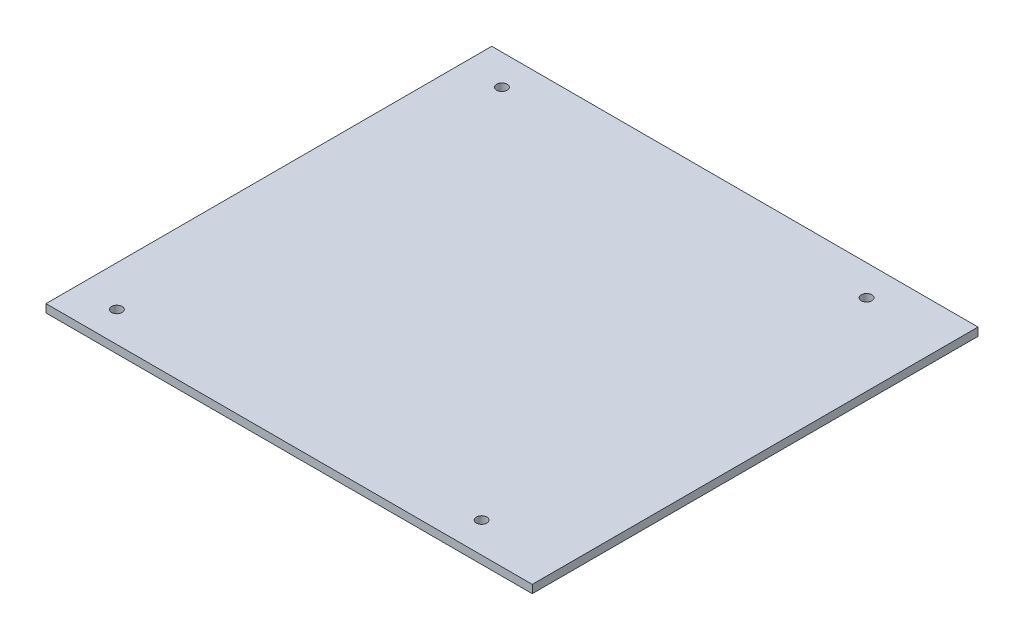
ISO-10303-21;
HEADER;
FILE_DESCRIPTION(('STEP AP214'),'2;1');
FILE_NAME('part.step','',(''),(''),'','','');
FILE_SCHEMA(('AUTOMOTIVE_DESIGN { 1 0 10303 214 1 1 1 1 }'));
ENDSEC;
DATA;
#1=APPLICATION_CONTEXT('core data for automotive mechanical design processes');
#2=APPLICATION_PROTOCOL_DEFINITION('international standard','automotive_design',2000,#1);
#3=PRODUCT_CONTEXT('',#1,'mechanical');
#4=PRODUCT('Part','Part','',(#3));
#5=PRODUCT_RELATED_PRODUCT_CATEGORY('part','',(#4));
#6=PRODUCT_DEFINITION_FORMATION('','',#4);
#7=PRODUCT_DEFINITION_CONTEXT('part definition',#1,'design');
#8=PRODUCT_DEFINITION('design','',#6,#7);
#9=PRODUCT_DEFINITION_SHAPE('','',#8);
#10=(LENGTH_UNIT() NAMED_UNIT(*) SI_UNIT(.MILLI.,.METRE.));
#11=(NAMED_UNIT(*) PLANE_ANGLE_UNIT() SI_UNIT($,.RADIAN.));
#12=(NAMED_UNIT(*) SI_UNIT($,.STERADIAN.) SOLID_ANGLE_UNIT());
#13=UNCERTAINTY_MEASURE_WITH_UNIT(LENGTH_MEASURE(1.E-05),#10,'distance_accuracy_value','');
#14=(GEOMETRIC_REPRESENTATION_CONTEXT(3) GLOBAL_UNCERTAINTY_ASSIGNED_CONTEXT((#13)) GLOBAL_UNIT_ASSIGNED_CONTEXT((#10,
#11,#12)) REPRESENTATION_CONTEXT('',''));
#15=CARTESIAN_POINT('',(0.,0.,0.));
#16=DIRECTION('',(0.,0.,1.));
#17=DIRECTION('',(1.,0.,0.));
#18=AXIS2_PLACEMENT_3D('',#15,#16,#17);
#19=CARTESIAN_POINT('',(-76.2,2.54,69.85));
#20=DIRECTION('',(1.,0.,0.));
#21=DIRECTION('',(0.,0.,-1.));
#22=AXIS2_PLACEMENT_3D('',#19,#20,#21);
#23=PLANE('',#22);
#24=DIRECTION('',(0.,0.,1.));
#25=VECTOR('',#24,1.);
#26=CARTESIAN_POINT('',(-76.2,0.,69.85));
#27=LINE('',#26,#25);
#28=CARTESIAN_POINT('',(-76.2,0.,-69.85));
#29=VERTEX_POINT('',#28);
#30=CARTESIAN_POINT('',(-76.2,0.,69.85));
#31=VERTEX_POINT('',#30);
#32=EDGE_CURVE('E101',#29,#31,#27,.T.);
#33=ORIENTED_EDGE('',*,*,#32,.T.);
#34=DIRECTION('',(0.,-1.,0.));
#35=VECTOR('',#34,1.);
#36=CARTESIAN_POINT('',(-76.2,2.54,69.85));
#37=LINE('',#36,#35);
#38=CARTESIAN_POINT('',(-76.2,2.54,69.85));
#39=VERTEX_POINT('',#38);
#40=EDGE_CURVE('E11',#39,#31,#37,.T.);
#41=ORIENTED_EDGE('',*,*,#40,.F.);
#42=DIRECTION('',(0.,0.,1.));
#43=VECTOR('',#42,1.);
#44=CARTESIAN_POINT('',(-76.2,2.54,69.85));
#45=LINE('',#44,#43);
#46=CARTESIAN_POINT('',(-76.2,2.54,-69.85));
#47=VERTEX_POINT('',#46);
#48=EDGE_CURVE('E88',#47,#39,#45,.T.);
#49=ORIENTED_EDGE('',*,*,#48,.F.);
#50=DIRECTION('',(0.,-1.,0.));
#51=VECTOR('',#50,1.);
#52=CARTESIAN_POINT('',(-76.2,2.54,-69.85));
#53=LINE('',#52,#51);
#54=EDGE_CURVE('E97',#47,#29,#53,.T.);
#55=ORIENTED_EDGE('',*,*,#54,.T.);
#56=EDGE_LOOP('',(#33,#41,#49,#55));
#57=FACE_BOUND('',#56,.T.);
#58=ADVANCED_FACE('F35',(#57),#23,.F.);
#59=CARTESIAN_POINT('',(76.2,2.54,69.85));
#60=DIRECTION('',(0.,0.,-1.));
#61=DIRECTION('',(-1.,0.,0.));
#62=AXIS2_PLACEMENT_3D('',#59,#60,#61);
#63=PLANE('',#62);
#64=DIRECTION('',(1.,0.,0.));
#65=VECTOR('',#64,1.);
#66=CARTESIAN_POINT('',(76.2,0.,69.85));
#67=LINE('',#66,#65);
#68=CARTESIAN_POINT('',(76.2,0.,69.85));
#69=VERTEX_POINT('',#68);
#70=EDGE_CURVE('E92',#31,#69,#67,.T.);
#71=ORIENTED_EDGE('',*,*,#70,.T.);
#72=DIRECTION('',(0.,-1.,0.));
#73=VECTOR('',#72,1.);
#74=CARTESIAN_POINT('',(76.2,2.54,69.85));
#75=LINE('',#74,#73);
#76=CARTESIAN_POINT('',(76.2,2.54,69.85));
#77=VERTEX_POINT('',#76);
#78=EDGE_CURVE('E44',#77,#69,#75,.T.);
#79=ORIENTED_EDGE('',*,*,#78,.F.);
#80=DIRECTION('',(1.,0.,0.));
#81=VECTOR('',#80,1.);
#82=CARTESIAN_POINT('',(76.2,2.54,69.85));
#83=LINE('',#82,#81);
#84=EDGE_CURVE('E83',#39,#77,#83,.T.);
#85=ORIENTED_EDGE('',*,*,#84,.F.);
#86=ORIENTED_EDGE('',*,*,#40,.T.);
#87=EDGE_LOOP('',(#71,#79,#85,#86));
#88=FACE_BOUND('',#87,.T.);
#89=ADVANCED_FACE('F91',(#88),#63,.F.);
#90=CARTESIAN_POINT('',(76.2,2.54,69.85));
#91=DIRECTION('',(-1.,0.,0.));
#92=DIRECTION('',(0.,0.,1.));
#93=AXIS2_PLACEMENT_3D('',#90,#91,#92);
#94=PLANE('',#93);
#95=DIRECTION('',(0.,0.,-1.));
#96=VECTOR('',#95,1.);
#97=CARTESIAN_POINT('',(76.2,0.,69.85));
#98=LINE('',#97,#96);
#99=CARTESIAN_POINT('',(76.2,0.,-69.85));
#100=VERTEX_POINT('',#99);
#101=EDGE_CURVE('E70',#69,#100,#98,.T.);
#102=ORIENTED_EDGE('',*,*,#101,.T.);
#103=DIRECTION('',(0.,-1.,0.));
#104=VECTOR('',#103,1.);
#105=CARTESIAN_POINT('',(76.2,2.54,-69.85));
#106=LINE('',#105,#104);
#107=CARTESIAN_POINT('',(76.2,2.54,-69.85));
#108=VERTEX_POINT('',#107);
#109=EDGE_CURVE('E93',#108,#100,#106,.T.);
#110=ORIENTED_EDGE('',*,*,#109,.F.);
#111=DIRECTION('',(0.,0.,-1.));
#112=VECTOR('',#111,1.);
#113=CARTESIAN_POINT('',(76.2,2.54,69.85));
#114=LINE('',#113,#112);
#115=EDGE_CURVE('E86',#77,#108,#114,.T.);
#116=ORIENTED_EDGE('',*,*,#115,.F.);
#117=ORIENTED_EDGE('',*,*,#78,.T.);
#118=EDGE_LOOP('',(#102,#110,#116,#117));
#119=FACE_BOUND('',#118,.T.);
#120=ADVANCED_FACE('F95',(#119),#94,.F.);
#121=CARTESIAN_POINT('',(76.2,2.54,-69.85));
#122=DIRECTION('',(0.,0.,1.));
#123=DIRECTION('',(1.,0.,0.));
#124=AXIS2_PLACEMENT_3D('',#121,#122,#123);
#125=PLANE('',#124);
#126=DIRECTION('',(-1.,0.,0.));
#127=VECTOR('',#126,1.);
#128=CARTESIAN_POINT('',(76.2,0.,-69.85));
#129=LINE('',#128,#127);
#130=EDGE_CURVE('E76',#100,#29,#129,.T.);
#131=ORIENTED_EDGE('',*,*,#130,.T.);
#132=ORIENTED_EDGE('',*,*,#54,.F.);
#133=DIRECTION('',(-1.,0.,0.));
#134=VECTOR('',#133,1.);
#135=CARTESIAN_POINT('',(76.2,2.54,-69.85));
#136=LINE('',#135,#134);
#137=EDGE_CURVE('E53',#108,#47,#136,.T.);
#138=ORIENTED_EDGE('',*,*,#137,.F.);
#139=ORIENTED_EDGE('',*,*,#109,.T.);
#140=EDGE_LOOP('',(#131,#132,#138,#139));
#141=FACE_BOUND('',#140,.T.);
#142=ADVANCED_FACE('F159',(#141),#125,.F.);
#143=CARTESIAN_POINT('',(0.,2.54,0.));
#144=DIRECTION('',(0.,1.,0.));
#145=DIRECTION('',(0.,0.,1.));
#146=AXIS2_PLACEMENT_3D('',#143,#144,#145);
#147=PLANE('',#146);
#148=CARTESIAN_POINT('',(-63.5,2.54,-60.325));
#149=DIRECTION('',(0.,1.,0.));
#150=DIRECTION('',(0.,0.,1.));
#151=AXIS2_PLACEMENT_3D('',#148,#149,#150);
#152=CIRCLE('',#151,1.65);
#153=CARTESIAN_POINT('',(-63.5,2.54,-58.675));
#154=VERTEX_POINT('',#153);
#155=EDGE_CURVE('E126',#154,#154,#152,.T.);
#156=ORIENTED_EDGE('',*,*,#155,.F.);
#157=EDGE_LOOP('',(#156));
#158=FACE_BOUND('',#157,.T.);
#159=CARTESIAN_POINT('',(-63.5,2.54,60.325));
#160=DIRECTION('',(0.,1.,0.));
#161=DIRECTION('',(0.,0.,1.));
#162=AXIS2_PLACEMENT_3D('',#159,#160,#161);
#163=CIRCLE('',#162,1.65);
#164=CARTESIAN_POINT('',(-63.5,2.54,61.975));
#165=VERTEX_POINT('',#164);
#166=EDGE_CURVE('E116',#165,#165,#163,.T.);
#167=ORIENTED_EDGE('',*,*,#166,.F.);
#168=EDGE_LOOP('',(#167));
#169=FACE_BOUND('',#168,.T.);
#170=CARTESIAN_POINT('',(50.8,2.54,60.325));
#171=DIRECTION('',(0.,1.,0.));
#172=DIRECTION('',(0.,0.,1.));
#173=AXIS2_PLACEMENT_3D('',#170,#171,#172);
#174=CIRCLE('',#173,1.65);
#175=CARTESIAN_POINT('',(50.8,2.54,61.975));
#176=VERTEX_POINT('',#175);
#177=EDGE_CURVE('E113',#176,#176,#174,.T.);
#178=ORIENTED_EDGE('',*,*,#177,.F.);
#179=EDGE_LOOP('',(#178));
#180=FACE_BOUND('',#179,.T.);
#181=CARTESIAN_POINT('',(50.8,2.54,-60.325));
#182=DIRECTION('',(0.,1.,0.));
#183=DIRECTION('',(0.,0.,1.));
#184=AXIS2_PLACEMENT_3D('',#181,#182,#183);
#185=CIRCLE('',#184,1.65);
#186=CARTESIAN_POINT('',(50.8,2.54,-58.675));
#187=VERTEX_POINT('',#186);
#188=EDGE_CURVE('E112',#187,#187,#185,.T.);
#189=ORIENTED_EDGE('',*,*,#188,.F.);
#190=EDGE_LOOP('',(#189));
#191=FACE_BOUND('',#190,.T.);
#192=ORIENTED_EDGE('',*,*,#48,.T.);
#193=ORIENTED_EDGE('',*,*,#84,.T.);
#194=ORIENTED_EDGE('',*,*,#115,.T.);
#195=ORIENTED_EDGE('',*,*,#137,.T.);
#196=EDGE_LOOP('',(#192,#193,#194,#195));
#197=FACE_BOUND('',#196,.T.);
#198=ADVANCED_FACE('F84',(#158,#169,#180,#191,#197),#147,.T.);
#199=CARTESIAN_POINT('',(0.,0.,0.));
#200=DIRECTION('',(0.,1.,0.));
#201=DIRECTION('',(0.,0.,1.));
#202=AXIS2_PLACEMENT_3D('',#199,#200,#201);
#203=PLANE('',#202);
#204=CARTESIAN_POINT('',(-63.5,0.,-60.325));
#205=DIRECTION('',(0.,1.,0.));
#206=DIRECTION('',(0.,0.,1.));
#207=AXIS2_PLACEMENT_3D('',#204,#205,#206);
#208=CIRCLE('',#207,1.65);
#209=CARTESIAN_POINT('',(-63.5,0.,-58.675));
#210=VERTEX_POINT('',#209);
#211=EDGE_CURVE('E38',#210,#210,#208,.T.);
#212=ORIENTED_EDGE('',*,*,#211,.T.);
#213=EDGE_LOOP('',(#212));
#214=FACE_BOUND('',#213,.T.);
#215=CARTESIAN_POINT('',(-63.5,0.,60.325));
#216=DIRECTION('',(0.,1.,0.));
#217=DIRECTION('',(0.,0.,1.));
#218=AXIS2_PLACEMENT_3D('',#215,#216,#217);
#219=CIRCLE('',#218,1.65);
#220=CARTESIAN_POINT('',(-63.5,0.,61.975));
#221=VERTEX_POINT('',#220);
#222=EDGE_CURVE('E114',#221,#221,#219,.T.);
#223=ORIENTED_EDGE('',*,*,#222,.T.);
#224=EDGE_LOOP('',(#223));
#225=FACE_BOUND('',#224,.T.);
#226=CARTESIAN_POINT('',(50.8,0.,60.325));
#227=DIRECTION('',(0.,1.,0.));
#228=DIRECTION('',(0.,0.,1.));
#229=AXIS2_PLACEMENT_3D('',#226,#227,#228);
#230=CIRCLE('',#229,1.65);
#231=CARTESIAN_POINT('',(50.8,0.,61.975));
#232=VERTEX_POINT('',#231);
#233=EDGE_CURVE('E110',#232,#232,#230,.T.);
#234=ORIENTED_EDGE('',*,*,#233,.T.);
#235=EDGE_LOOP('',(#234));
#236=FACE_BOUND('',#235,.T.);
#237=CARTESIAN_POINT('',(50.8,0.,-60.325));
#238=DIRECTION('',(0.,1.,0.));
#239=DIRECTION('',(0.,0.,1.));
#240=AXIS2_PLACEMENT_3D('',#237,#238,#239);
#241=CIRCLE('',#240,1.65);
#242=CARTESIAN_POINT('',(50.8,0.,-58.675));
#243=VERTEX_POINT('',#242);
#244=EDGE_CURVE('E104',#243,#243,#241,.T.);
#245=ORIENTED_EDGE('',*,*,#244,.T.);
#246=EDGE_LOOP('',(#245));
#247=FACE_BOUND('',#246,.T.);
#248=ORIENTED_EDGE('',*,*,#32,.F.);
#249=ORIENTED_EDGE('',*,*,#130,.F.);
#250=ORIENTED_EDGE('',*,*,#101,.F.);
#251=ORIENTED_EDGE('',*,*,#70,.F.);
#252=EDGE_LOOP('',(#248,#249,#250,#251));
#253=FACE_BOUND('',#252,.T.);
#254=ADVANCED_FACE('F134',(#214,#225,#236,#247,#253),#203,.F.);
#255=CARTESIAN_POINT('',(50.8,2.54,-60.325));
#256=DIRECTION('',(0.,1.,0.));
#257=DIRECTION('',(0.,0.,1.));
#258=AXIS2_PLACEMENT_3D('',#255,#256,#257);
#259=CYLINDRICAL_SURFACE('',#258,1.65);
#260=ORIENTED_EDGE('',*,*,#188,.T.);
#261=EDGE_LOOP('',(#260));
#262=FACE_BOUND('',#261,.T.);
#263=ORIENTED_EDGE('',*,*,#244,.F.);
#264=EDGE_LOOP('',(#263));
#265=FACE_BOUND('',#264,.T.);
#266=ADVANCED_FACE('F137',(#262,#265),#259,.F.);
#267=CARTESIAN_POINT('',(50.8,2.54,60.325));
#268=DIRECTION('',(0.,1.,0.));
#269=DIRECTION('',(0.,0.,1.));
#270=AXIS2_PLACEMENT_3D('',#267,#268,#269);
#271=CYLINDRICAL_SURFACE('',#270,1.65);
#272=ORIENTED_EDGE('',*,*,#177,.T.);
#273=EDGE_LOOP('',(#272));
#274=FACE_BOUND('',#273,.T.);
#275=ORIENTED_EDGE('',*,*,#233,.F.);
#276=EDGE_LOOP('',(#275));
#277=FACE_BOUND('',#276,.T.);
#278=ADVANCED_FACE('F139',(#274,#277),#271,.F.);
#279=CARTESIAN_POINT('',(-63.5,2.54,60.325));
#280=DIRECTION('',(0.,1.,0.));
#281=DIRECTION('',(0.,0.,1.));
#282=AXIS2_PLACEMENT_3D('',#279,#280,#281);
#283=CYLINDRICAL_SURFACE('',#282,1.65);
#284=ORIENTED_EDGE('',*,*,#166,.T.);
#285=EDGE_LOOP('',(#284));
#286=FACE_BOUND('',#285,.T.);
#287=ORIENTED_EDGE('',*,*,#222,.F.);
#288=EDGE_LOOP('',(#287));
#289=FACE_BOUND('',#288,.T.);
#290=ADVANCED_FACE('F146',(#286,#289),#283,.F.);
#291=CARTESIAN_POINT('',(-63.5,2.54,-60.325));
#292=DIRECTION('',(0.,1.,0.));
#293=DIRECTION('',(0.,0.,1.));
#294=AXIS2_PLACEMENT_3D('',#291,#292,#293);
#295=CYLINDRICAL_SURFACE('',#294,1.65);
#296=ORIENTED_EDGE('',*,*,#155,.T.);
#297=EDGE_LOOP('',(#296));
#298=FACE_BOUND('',#297,.T.);
#299=ORIENTED_EDGE('',*,*,#211,.F.);
#300=EDGE_LOOP('',(#299));
#301=FACE_BOUND('',#300,.T.);
#302=ADVANCED_FACE('F214',(#298,#301),#295,.F.);
#303=CLOSED_SHELL('',(#58,#89,#120,#142,#198,#254,#266,#278,#290,#302));
#304=MANIFOLD_SOLID_BREP('B2',#303);
#305=ADVANCED_BREP_SHAPE_REPRESENTATION('',(#18,#304),#14);
#306=SHAPE_DEFINITION_REPRESENTATION(#9,#305);
ENDSEC;
END-ISO-10303-21;
